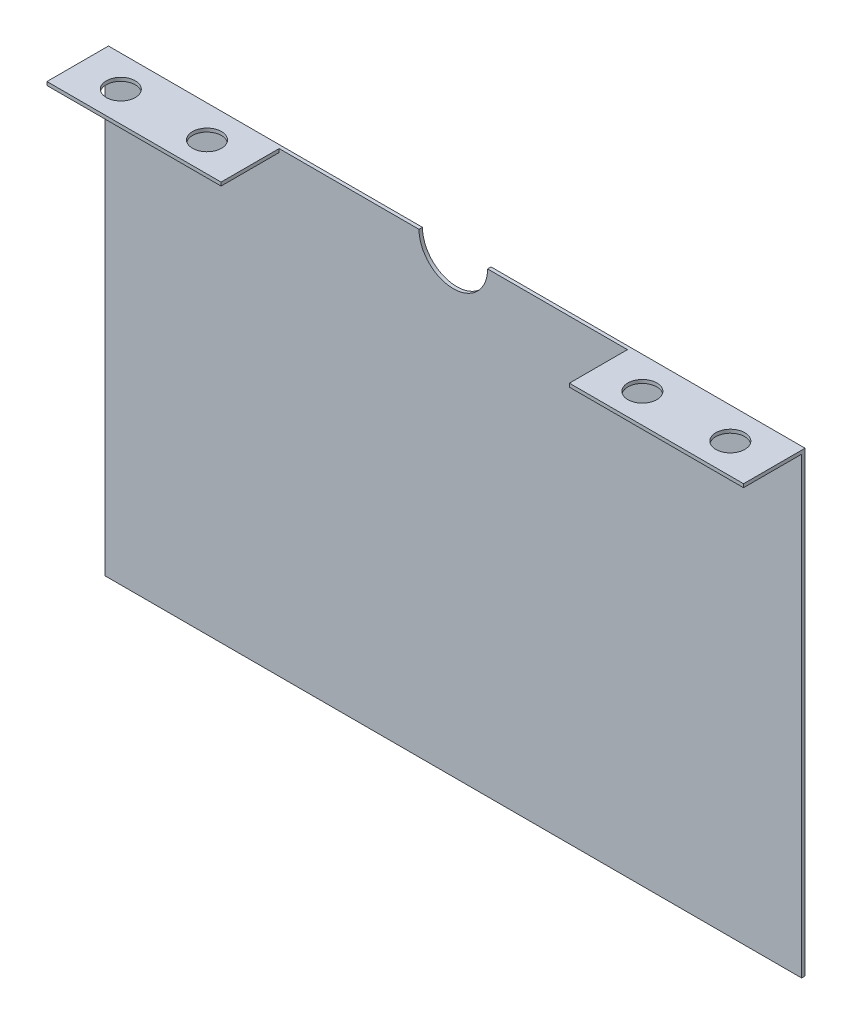
ISO-10303-21;
HEADER;
FILE_DESCRIPTION(('STEP AP214'),'2;1');
FILE_NAME('part.step','',(''),(''),'','','');
FILE_SCHEMA(('AUTOMOTIVE_DESIGN { 1 0 10303 214 1 1 1 1 }'));
ENDSEC;
DATA;
#1=APPLICATION_CONTEXT('core data for automotive mechanical design processes');
#2=APPLICATION_PROTOCOL_DEFINITION('international standard','automotive_design',2000,#1);
#3=PRODUCT_CONTEXT('',#1,'mechanical');
#4=PRODUCT('Part','Part','',(#3));
#5=PRODUCT_RELATED_PRODUCT_CATEGORY('part','',(#4));
#6=PRODUCT_DEFINITION_FORMATION('','',#4);
#7=PRODUCT_DEFINITION_CONTEXT('part definition',#1,'design');
#8=PRODUCT_DEFINITION('design','',#6,#7);
#9=PRODUCT_DEFINITION_SHAPE('','',#8);
#10=(LENGTH_UNIT() NAMED_UNIT(*) SI_UNIT(.MILLI.,.METRE.));
#11=(NAMED_UNIT(*) PLANE_ANGLE_UNIT() SI_UNIT($,.RADIAN.));
#12=(NAMED_UNIT(*) SI_UNIT($,.STERADIAN.) SOLID_ANGLE_UNIT());
#13=UNCERTAINTY_MEASURE_WITH_UNIT(LENGTH_MEASURE(1.E-05),#10,'distance_accuracy_value','');
#14=(GEOMETRIC_REPRESENTATION_CONTEXT(3) GLOBAL_UNCERTAINTY_ASSIGNED_CONTEXT((#13)) GLOBAL_UNIT_ASSIGNED_CONTEXT((#10,
#11,#12)) REPRESENTATION_CONTEXT('',''));
#15=CARTESIAN_POINT('',(0.,0.,0.));
#16=DIRECTION('',(0.,0.,1.));
#17=DIRECTION('',(1.,0.,0.));
#18=AXIS2_PLACEMENT_3D('',#15,#16,#17);
#19=CARTESIAN_POINT('',(0.,100.,1.51892));
#20=DIRECTION('',(0.,0.,-1.));
#21=DIRECTION('',(-1.,0.,0.));
#22=AXIS2_PLACEMENT_3D('',#19,#20,#21);
#23=PLANE('',#22);
#24=DIRECTION('',(0.,-1.,0.));
#25=VECTOR('',#24,1.);
#26=CARTESIAN_POINT('',(76.2,100.,1.51892));
#27=LINE('',#26,#25);
#28=CARTESIAN_POINT('',(76.2,100.,1.51892));
#29=VERTEX_POINT('',#28);
#30=CARTESIAN_POINT('',(76.2,98.48108,1.51892));
#31=VERTEX_POINT('',#30);
#32=EDGE_CURVE('E155',#29,#31,#27,.T.);
#33=ORIENTED_EDGE('',*,*,#32,.F.);
#34=DIRECTION('',(-1.,0.,0.));
#35=VECTOR('',#34,1.);
#36=CARTESIAN_POINT('',(15.,100.,1.51892));
#37=LINE('',#36,#35);
#38=CARTESIAN_POINT('',(15.,100.,1.51892));
#39=VERTEX_POINT('',#38);
#40=EDGE_CURVE('E202',#29,#39,#37,.T.);
#41=ORIENTED_EDGE('',*,*,#40,.T.);
#42=CARTESIAN_POINT('',(0.,100.,1.51892));
#43=DIRECTION('',(0.,0.,-1.));
#44=DIRECTION('',(-1.,0.,0.));
#45=AXIS2_PLACEMENT_3D('',#42,#43,#44);
#46=CIRCLE('',#45,15.);
#47=CARTESIAN_POINT('',(-15.,100.,1.51892));
#48=VERTEX_POINT('',#47);
#49=EDGE_CURVE('E204',#39,#48,#46,.T.);
#50=ORIENTED_EDGE('',*,*,#49,.T.);
#51=DIRECTION('',(-1.,0.,0.));
#52=VECTOR('',#51,1.);
#53=CARTESIAN_POINT('',(-152.4,100.,1.51892));
#54=LINE('',#53,#52);
#55=CARTESIAN_POINT('',(-76.2,100.,1.51892));
#56=VERTEX_POINT('',#55);
#57=EDGE_CURVE('E206',#48,#56,#54,.T.);
#58=ORIENTED_EDGE('',*,*,#57,.T.);
#59=DIRECTION('',(0.,1.,0.));
#60=VECTOR('',#59,1.);
#61=CARTESIAN_POINT('',(-76.2,100.,1.51892));
#62=LINE('',#61,#60);
#63=CARTESIAN_POINT('',(-76.2,98.48108,1.51892));
#64=VERTEX_POINT('',#63);
#65=EDGE_CURVE('E175',#64,#56,#62,.T.);
#66=ORIENTED_EDGE('',*,*,#65,.F.);
#67=DIRECTION('',(1.,0.,0.));
#68=VECTOR('',#67,1.);
#69=CARTESIAN_POINT('',(-152.4,98.48108,1.51892));
#70=LINE('',#69,#68);
#71=CARTESIAN_POINT('',(-152.4,98.48108,1.51892));
#72=VERTEX_POINT('',#71);
#73=EDGE_CURVE('E170',#72,#64,#70,.T.);
#74=ORIENTED_EDGE('',*,*,#73,.F.);
#75=DIRECTION('',(0.,-1.,0.));
#76=VECTOR('',#75,1.);
#77=CARTESIAN_POINT('',(-152.4,100.,1.51892));
#78=LINE('',#77,#76);
#79=CARTESIAN_POINT('',(-152.4,-100.,1.51892));
#80=VERTEX_POINT('',#79);
#81=EDGE_CURVE('E196',#72,#80,#78,.T.);
#82=ORIENTED_EDGE('',*,*,#81,.T.);
#83=DIRECTION('',(1.,0.,0.));
#84=VECTOR('',#83,1.);
#85=CARTESIAN_POINT('',(-152.4,-100.,1.51892));
#86=LINE('',#85,#84);
#87=CARTESIAN_POINT('',(152.4,-100.,1.51892));
#88=VERTEX_POINT('',#87);
#89=EDGE_CURVE('E198',#80,#88,#86,.T.);
#90=ORIENTED_EDGE('',*,*,#89,.T.);
#91=DIRECTION('',(0.,1.,0.));
#92=VECTOR('',#91,1.);
#93=CARTESIAN_POINT('',(152.4,100.,1.51892));
#94=LINE('',#93,#92);
#95=CARTESIAN_POINT('',(152.4,98.48108,1.51892));
#96=VERTEX_POINT('',#95);
#97=EDGE_CURVE('E60',#88,#96,#94,.T.);
#98=ORIENTED_EDGE('',*,*,#97,.T.);
#99=DIRECTION('',(1.,0.,0.));
#100=VECTOR('',#99,1.);
#101=CARTESIAN_POINT('',(152.4,98.48108,1.51892));
#102=LINE('',#101,#100);
#103=EDGE_CURVE('E55',#31,#96,#102,.T.);
#104=ORIENTED_EDGE('',*,*,#103,.F.);
#105=EDGE_LOOP('',(#33,#41,#50,#58,#66,#74,#82,#90,#98,#104));
#106=FACE_BOUND('',#105,.T.);
#107=ADVANCED_FACE('F38',(#106),#23,.F.);
#108=CARTESIAN_POINT('',(-152.4,100.,1.51892));
#109=DIRECTION('',(1.,0.,0.));
#110=DIRECTION('',(0.,0.,-1.));
#111=AXIS2_PLACEMENT_3D('',#108,#109,#110);
#112=PLANE('',#111);
#113=DIRECTION('',(0.,-1.,0.));
#114=VECTOR('',#113,1.);
#115=CARTESIAN_POINT('',(-152.4,100.,0.));
#116=LINE('',#115,#114);
#117=CARTESIAN_POINT('',(-152.4,100.,0.));
#118=VERTEX_POINT('',#117);
#119=CARTESIAN_POINT('',(-152.4,-100.,0.));
#120=VERTEX_POINT('',#119);
#121=EDGE_CURVE('E195',#118,#120,#116,.T.);
#122=ORIENTED_EDGE('',*,*,#121,.T.);
#123=DIRECTION('',(0.,0.,-1.));
#124=VECTOR('',#123,1.);
#125=CARTESIAN_POINT('',(-152.4,-100.,1.51892));
#126=LINE('',#125,#124);
#127=EDGE_CURVE('E11',#80,#120,#126,.T.);
#128=ORIENTED_EDGE('',*,*,#127,.F.);
#129=ORIENTED_EDGE('',*,*,#81,.F.);
#130=DIRECTION('',(0.,0.,-1.));
#131=VECTOR('',#130,1.);
#132=CARTESIAN_POINT('',(-152.4,98.48108,26.91892));
#133=LINE('',#132,#131);
#134=CARTESIAN_POINT('',(-152.4,98.48108,26.91892));
#135=VERTEX_POINT('',#134);
#136=EDGE_CURVE('E192',#135,#72,#133,.T.);
#137=ORIENTED_EDGE('',*,*,#136,.F.);
#138=DIRECTION('',(0.,-1.,0.));
#139=VECTOR('',#138,1.);
#140=CARTESIAN_POINT('',(-152.4,100.,26.91892));
#141=LINE('',#140,#139);
#142=CARTESIAN_POINT('',(-152.4,100.,26.91892));
#143=VERTEX_POINT('',#142);
#144=EDGE_CURVE('E171',#143,#135,#141,.T.);
#145=ORIENTED_EDGE('',*,*,#144,.F.);
#146=DIRECTION('',(0.,0.,-1.));
#147=VECTOR('',#146,1.);
#148=CARTESIAN_POINT('',(-152.4,100.,1.51892));
#149=LINE('',#148,#147);
#150=EDGE_CURVE('E208',#143,#118,#149,.T.);
#151=ORIENTED_EDGE('',*,*,#150,.T.);
#152=EDGE_LOOP('',(#122,#128,#129,#137,#145,#151));
#153=FACE_BOUND('',#152,.T.);
#154=ADVANCED_FACE('F40',(#153),#112,.F.);
#155=CARTESIAN_POINT('',(-152.4,-100.,1.51892));
#156=DIRECTION('',(0.,1.,0.));
#157=DIRECTION('',(-1.,0.,0.));
#158=AXIS2_PLACEMENT_3D('',#155,#156,#157);
#159=PLANE('',#158);
#160=DIRECTION('',(1.,0.,0.));
#161=VECTOR('',#160,1.);
#162=CARTESIAN_POINT('',(-152.4,-100.,0.));
#163=LINE('',#162,#161);
#164=CARTESIAN_POINT('',(152.4,-100.,0.));
#165=VERTEX_POINT('',#164);
#166=EDGE_CURVE('E211',#120,#165,#163,.T.);
#167=ORIENTED_EDGE('',*,*,#166,.T.);
#168=DIRECTION('',(0.,0.,-1.));
#169=VECTOR('',#168,1.);
#170=CARTESIAN_POINT('',(152.4,-100.,1.51892));
#171=LINE('',#170,#169);
#172=EDGE_CURVE('E47',#88,#165,#171,.T.);
#173=ORIENTED_EDGE('',*,*,#172,.F.);
#174=ORIENTED_EDGE('',*,*,#89,.F.);
#175=ORIENTED_EDGE('',*,*,#127,.T.);
#176=EDGE_LOOP('',(#167,#173,#174,#175));
#177=FACE_BOUND('',#176,.T.);
#178=ADVANCED_FACE('F259',(#177),#159,.F.);
#179=CARTESIAN_POINT('',(152.4,100.,1.51892));
#180=DIRECTION('',(-1.,0.,0.));
#181=DIRECTION('',(0.,0.,1.));
#182=AXIS2_PLACEMENT_3D('',#179,#180,#181);
#183=PLANE('',#182);
#184=DIRECTION('',(0.,1.,0.));
#185=VECTOR('',#184,1.);
#186=CARTESIAN_POINT('',(152.4,100.,0.));
#187=LINE('',#186,#185);
#188=CARTESIAN_POINT('',(152.4,100.,0.));
#189=VERTEX_POINT('',#188);
#190=EDGE_CURVE('E136',#165,#189,#187,.T.);
#191=ORIENTED_EDGE('',*,*,#190,.T.);
#192=DIRECTION('',(0.,0.,-1.));
#193=VECTOR('',#192,1.);
#194=CARTESIAN_POINT('',(152.4,100.,1.51892));
#195=LINE('',#194,#193);
#196=CARTESIAN_POINT('',(152.4,100.,26.91892));
#197=VERTEX_POINT('',#196);
#198=EDGE_CURVE('E128',#197,#189,#195,.T.);
#199=ORIENTED_EDGE('',*,*,#198,.F.);
#200=DIRECTION('',(0.,1.,0.));
#201=VECTOR('',#200,1.);
#202=CARTESIAN_POINT('',(152.4,100.,26.91892));
#203=LINE('',#202,#201);
#204=CARTESIAN_POINT('',(152.4,98.48108,26.91892));
#205=VERTEX_POINT('',#204);
#206=EDGE_CURVE('E133',#205,#197,#203,.T.);
#207=ORIENTED_EDGE('',*,*,#206,.F.);
#208=DIRECTION('',(0.,0.,-1.));
#209=VECTOR('',#208,1.);
#210=CARTESIAN_POINT('',(152.4,98.48108,26.91892));
#211=LINE('',#210,#209);
#212=EDGE_CURVE('E163',#205,#96,#211,.T.);
#213=ORIENTED_EDGE('',*,*,#212,.T.);
#214=ORIENTED_EDGE('',*,*,#97,.F.);
#215=ORIENTED_EDGE('',*,*,#172,.T.);
#216=EDGE_LOOP('',(#191,#199,#207,#213,#214,#215));
#217=FACE_BOUND('',#216,.T.);
#218=ADVANCED_FACE('F130',(#217),#183,.F.);
#219=CARTESIAN_POINT('',(15.,100.,1.51892));
#220=DIRECTION('',(0.,-1.,0.));
#221=DIRECTION('',(1.,0.,0.));
#222=AXIS2_PLACEMENT_3D('',#219,#220,#221);
#223=PLANE('',#222);
#224=CARTESIAN_POINT('',(95.25,100.,14.029055));
#225=DIRECTION('',(0.,1.,0.));
#226=DIRECTION('',(0.,0.,-1.));
#227=AXIS2_PLACEMENT_3D('',#224,#225,#226);
#228=CIRCLE('',#227,6.35);
#229=CARTESIAN_POINT('',(95.25,100.,7.679055));
#230=VERTEX_POINT('',#229);
#231=EDGE_CURVE('E413',#230,#230,#228,.T.);
#232=ORIENTED_EDGE('',*,*,#231,.F.);
#233=EDGE_LOOP('',(#232));
#234=FACE_BOUND('',#233,.T.);
#235=CARTESIAN_POINT('',(133.35,100.,13.649325));
#236=DIRECTION('',(0.,1.,0.));
#237=DIRECTION('',(0.,0.,-1.));
#238=AXIS2_PLACEMENT_3D('',#235,#236,#237);
#239=CIRCLE('',#238,6.35);
#240=CARTESIAN_POINT('',(133.35,100.,7.299325));
#241=VERTEX_POINT('',#240);
#242=EDGE_CURVE('E158',#241,#241,#239,.T.);
#243=ORIENTED_EDGE('',*,*,#242,.F.);
#244=EDGE_LOOP('',(#243));
#245=FACE_BOUND('',#244,.T.);
#246=DIRECTION('',(-1.,0.,0.));
#247=VECTOR('',#246,1.);
#248=CARTESIAN_POINT('',(15.,100.,0.));
#249=LINE('',#248,#247);
#250=CARTESIAN_POINT('',(15.,100.,0.));
#251=VERTEX_POINT('',#250);
#252=EDGE_CURVE('E214',#189,#251,#249,.T.);
#253=ORIENTED_EDGE('',*,*,#252,.T.);
#254=DIRECTION('',(0.,0.,-1.));
#255=VECTOR('',#254,1.);
#256=CARTESIAN_POINT('',(15.,100.,1.51892));
#257=LINE('',#256,#255);
#258=EDGE_CURVE('E139',#39,#251,#257,.T.);
#259=ORIENTED_EDGE('',*,*,#258,.F.);
#260=ORIENTED_EDGE('',*,*,#40,.F.);
#261=DIRECTION('',(0.,0.,-1.));
#262=VECTOR('',#261,1.);
#263=CARTESIAN_POINT('',(76.2,100.,26.91892));
#264=LINE('',#263,#262);
#265=CARTESIAN_POINT('',(76.2,100.,26.91892));
#266=VERTEX_POINT('',#265);
#267=EDGE_CURVE('E145',#266,#29,#264,.T.);
#268=ORIENTED_EDGE('',*,*,#267,.F.);
#269=DIRECTION('',(-1.,0.,0.));
#270=VECTOR('',#269,1.);
#271=CARTESIAN_POINT('',(152.4,100.,26.91892));
#272=LINE('',#271,#270);
#273=EDGE_CURVE('E142',#197,#266,#272,.T.);
#274=ORIENTED_EDGE('',*,*,#273,.F.);
#275=ORIENTED_EDGE('',*,*,#198,.T.);
#276=EDGE_LOOP('',(#253,#259,#260,#268,#274,#275));
#277=FACE_BOUND('',#276,.T.);
#278=ADVANCED_FACE('F143',(#234,#245,#277),#223,.F.);
#279=CARTESIAN_POINT('',(0.,100.,1.51892));
#280=DIRECTION('',(0.,0.,-1.));
#281=DIRECTION('',(-1.,0.,0.));
#282=AXIS2_PLACEMENT_3D('',#279,#280,#281);
#283=CYLINDRICAL_SURFACE('',#282,15.);
#284=CARTESIAN_POINT('',(0.,100.,0.));
#285=DIRECTION('',(0.,0.,-1.));
#286=DIRECTION('',(-1.,0.,0.));
#287=AXIS2_PLACEMENT_3D('',#284,#285,#286);
#288=CIRCLE('',#287,15.);
#289=CARTESIAN_POINT('',(-15.,100.,0.));
#290=VERTEX_POINT('',#289);
#291=EDGE_CURVE('E216',#251,#290,#288,.T.);
#292=ORIENTED_EDGE('',*,*,#291,.T.);
#293=DIRECTION('',(0.,0.,-1.));
#294=VECTOR('',#293,1.);
#295=CARTESIAN_POINT('',(-15.,100.,1.51892));
#296=LINE('',#295,#294);
#297=EDGE_CURVE('E221',#48,#290,#296,.T.);
#298=ORIENTED_EDGE('',*,*,#297,.F.);
#299=ORIENTED_EDGE('',*,*,#49,.F.);
#300=ORIENTED_EDGE('',*,*,#258,.T.);
#301=EDGE_LOOP('',(#292,#298,#299,#300));
#302=FACE_BOUND('',#301,.T.);
#303=ADVANCED_FACE('F271',(#302),#283,.F.);
#304=CARTESIAN_POINT('',(-152.4,100.,1.51892));
#305=DIRECTION('',(0.,-1.,0.));
#306=DIRECTION('',(0.,0.,-1.));
#307=AXIS2_PLACEMENT_3D('',#304,#305,#306);
#308=PLANE('',#307);
#309=CARTESIAN_POINT('',(-133.35,100.,13.649325));
#310=DIRECTION('',(0.,1.,0.));
#311=DIRECTION('',(0.,0.,1.));
#312=AXIS2_PLACEMENT_3D('',#309,#310,#311);
#313=CIRCLE('',#312,6.35);
#314=CARTESIAN_POINT('',(-133.35,100.,19.999325));
#315=VERTEX_POINT('',#314);
#316=EDGE_CURVE('E231',#315,#315,#313,.T.);
#317=ORIENTED_EDGE('',*,*,#316,.F.);
#318=EDGE_LOOP('',(#317));
#319=FACE_BOUND('',#318,.T.);
#320=CARTESIAN_POINT('',(-95.25,100.,14.029055));
#321=DIRECTION('',(0.,1.,0.));
#322=DIRECTION('',(0.,0.,1.));
#323=AXIS2_PLACEMENT_3D('',#320,#321,#322);
#324=CIRCLE('',#323,6.35);
#325=CARTESIAN_POINT('',(-95.25,100.,20.379055));
#326=VERTEX_POINT('',#325);
#327=EDGE_CURVE('E415',#326,#326,#324,.T.);
#328=ORIENTED_EDGE('',*,*,#327,.F.);
#329=EDGE_LOOP('',(#328));
#330=FACE_BOUND('',#329,.T.);
#331=DIRECTION('',(-1.,0.,0.));
#332=VECTOR('',#331,1.);
#333=CARTESIAN_POINT('',(-152.4,100.,0.));
#334=LINE('',#333,#332);
#335=EDGE_CURVE('E199',#290,#118,#334,.T.);
#336=ORIENTED_EDGE('',*,*,#335,.T.);
#337=ORIENTED_EDGE('',*,*,#150,.F.);
#338=DIRECTION('',(-1.,0.,0.));
#339=VECTOR('',#338,1.);
#340=CARTESIAN_POINT('',(-152.4,100.,26.91892));
#341=LINE('',#340,#339);
#342=CARTESIAN_POINT('',(-76.2,100.,26.91892));
#343=VERTEX_POINT('',#342);
#344=EDGE_CURVE('E179',#343,#143,#341,.T.);
#345=ORIENTED_EDGE('',*,*,#344,.F.);
#346=DIRECTION('',(0.,0.,-1.));
#347=VECTOR('',#346,1.);
#348=CARTESIAN_POINT('',(-76.2,100.,26.91892));
#349=LINE('',#348,#347);
#350=EDGE_CURVE('E182',#343,#56,#349,.T.);
#351=ORIENTED_EDGE('',*,*,#350,.T.);
#352=ORIENTED_EDGE('',*,*,#57,.F.);
#353=ORIENTED_EDGE('',*,*,#297,.T.);
#354=EDGE_LOOP('',(#336,#337,#345,#351,#352,#353));
#355=FACE_BOUND('',#354,.T.);
#356=ADVANCED_FACE('F267',(#319,#330,#355),#308,.F.);
#357=CARTESIAN_POINT('',(0.,100.,0.));
#358=DIRECTION('',(0.,0.,-1.));
#359=DIRECTION('',(-1.,0.,0.));
#360=AXIS2_PLACEMENT_3D('',#357,#358,#359);
#361=PLANE('',#360);
#362=ORIENTED_EDGE('',*,*,#121,.F.);
#363=ORIENTED_EDGE('',*,*,#335,.F.);
#364=ORIENTED_EDGE('',*,*,#291,.F.);
#365=ORIENTED_EDGE('',*,*,#252,.F.);
#366=ORIENTED_EDGE('',*,*,#190,.F.);
#367=ORIENTED_EDGE('',*,*,#166,.F.);
#368=EDGE_LOOP('',(#362,#363,#364,#365,#366,#367));
#369=FACE_BOUND('',#368,.T.);
#370=ADVANCED_FACE('F264',(#369),#361,.T.);
#371=CARTESIAN_POINT('',(-152.4,98.48108,26.91892));
#372=DIRECTION('',(0.,1.,0.));
#373=DIRECTION('',(0.,0.,1.));
#374=AXIS2_PLACEMENT_3D('',#371,#372,#373);
#375=PLANE('',#374);
#376=CARTESIAN_POINT('',(-133.35,98.48108,13.649325));
#377=DIRECTION('',(0.,1.,0.));
#378=DIRECTION('',(0.,0.,1.));
#379=AXIS2_PLACEMENT_3D('',#376,#377,#378);
#380=CIRCLE('',#379,6.35);
#381=CARTESIAN_POINT('',(-133.35,98.48108,19.999325));
#382=VERTEX_POINT('',#381);
#383=EDGE_CURVE('E42',#382,#382,#380,.T.);
#384=ORIENTED_EDGE('',*,*,#383,.T.);
#385=EDGE_LOOP('',(#384));
#386=FACE_BOUND('',#385,.T.);
#387=CARTESIAN_POINT('',(-95.25,98.48108,14.029055));
#388=DIRECTION('',(0.,1.,0.));
#389=DIRECTION('',(0.,0.,1.));
#390=AXIS2_PLACEMENT_3D('',#387,#388,#389);
#391=CIRCLE('',#390,6.35);
#392=CARTESIAN_POINT('',(-95.25,98.48108,20.379055));
#393=VERTEX_POINT('',#392);
#394=EDGE_CURVE('E233',#393,#393,#391,.T.);
#395=ORIENTED_EDGE('',*,*,#394,.T.);
#396=EDGE_LOOP('',(#395));
#397=FACE_BOUND('',#396,.T.);
#398=ORIENTED_EDGE('',*,*,#73,.T.);
#399=DIRECTION('',(0.,0.,-1.));
#400=VECTOR('',#399,1.);
#401=CARTESIAN_POINT('',(-76.2,98.48108,26.91892));
#402=LINE('',#401,#400);
#403=CARTESIAN_POINT('',(-76.2,98.48108,26.91892));
#404=VERTEX_POINT('',#403);
#405=EDGE_CURVE('E189',#404,#64,#402,.T.);
#406=ORIENTED_EDGE('',*,*,#405,.F.);
#407=DIRECTION('',(1.,0.,0.));
#408=VECTOR('',#407,1.);
#409=CARTESIAN_POINT('',(-152.4,98.48108,26.91892));
#410=LINE('',#409,#408);
#411=EDGE_CURVE('E174',#135,#404,#410,.T.);
#412=ORIENTED_EDGE('',*,*,#411,.F.);
#413=ORIENTED_EDGE('',*,*,#136,.T.);
#414=EDGE_LOOP('',(#398,#406,#412,#413));
#415=FACE_BOUND('',#414,.T.);
#416=ADVANCED_FACE('F240',(#386,#397,#415),#375,.F.);
#417=CARTESIAN_POINT('',(-76.2,100.,26.91892));
#418=DIRECTION('',(-1.,0.,0.));
#419=DIRECTION('',(0.,-1.,0.));
#420=AXIS2_PLACEMENT_3D('',#417,#418,#419);
#421=PLANE('',#420);
#422=ORIENTED_EDGE('',*,*,#65,.T.);
#423=ORIENTED_EDGE('',*,*,#350,.F.);
#424=DIRECTION('',(0.,1.,0.));
#425=VECTOR('',#424,1.);
#426=CARTESIAN_POINT('',(-76.2,100.,26.91892));
#427=LINE('',#426,#425);
#428=EDGE_CURVE('E177',#404,#343,#427,.T.);
#429=ORIENTED_EDGE('',*,*,#428,.F.);
#430=ORIENTED_EDGE('',*,*,#405,.T.);
#431=EDGE_LOOP('',(#422,#423,#429,#430));
#432=FACE_BOUND('',#431,.T.);
#433=ADVANCED_FACE('F314',(#432),#421,.F.);
#434=CARTESIAN_POINT('',(0.,0.,26.91892));
#435=DIRECTION('',(0.,0.,1.));
#436=DIRECTION('',(1.,0.,0.));
#437=AXIS2_PLACEMENT_3D('',#434,#435,#436);
#438=PLANE('',#437);
#439=ORIENTED_EDGE('',*,*,#144,.T.);
#440=ORIENTED_EDGE('',*,*,#411,.T.);
#441=ORIENTED_EDGE('',*,*,#428,.T.);
#442=ORIENTED_EDGE('',*,*,#344,.T.);
#443=EDGE_LOOP('',(#439,#440,#441,#442));
#444=FACE_BOUND('',#443,.T.);
#445=ADVANCED_FACE('F308',(#444),#438,.T.);
#446=CARTESIAN_POINT('',(76.2,100.,26.91892));
#447=DIRECTION('',(1.,0.,0.));
#448=DIRECTION('',(0.,1.,0.));
#449=AXIS2_PLACEMENT_3D('',#446,#447,#448);
#450=PLANE('',#449);
#451=ORIENTED_EDGE('',*,*,#32,.T.);
#452=DIRECTION('',(0.,0.,-1.));
#453=VECTOR('',#452,1.);
#454=CARTESIAN_POINT('',(76.2,98.48108,26.91892));
#455=LINE('',#454,#453);
#456=CARTESIAN_POINT('',(76.2,98.48108,26.91892));
#457=VERTEX_POINT('',#456);
#458=EDGE_CURVE('E166',#457,#31,#455,.T.);
#459=ORIENTED_EDGE('',*,*,#458,.F.);
#460=DIRECTION('',(0.,-1.,0.));
#461=VECTOR('',#460,1.);
#462=CARTESIAN_POINT('',(76.2,100.,26.91892));
#463=LINE('',#462,#461);
#464=EDGE_CURVE('E148',#266,#457,#463,.T.);
#465=ORIENTED_EDGE('',*,*,#464,.F.);
#466=ORIENTED_EDGE('',*,*,#267,.T.);
#467=EDGE_LOOP('',(#451,#459,#465,#466));
#468=FACE_BOUND('',#467,.T.);
#469=ADVANCED_FACE('F296',(#468),#450,.F.);
#470=CARTESIAN_POINT('',(152.4,98.48108,26.91892));
#471=DIRECTION('',(0.,1.,0.));
#472=DIRECTION('',(-1.,0.,0.));
#473=AXIS2_PLACEMENT_3D('',#470,#471,#472);
#474=PLANE('',#473);
#475=CARTESIAN_POINT('',(95.25,98.48108,14.029055));
#476=DIRECTION('',(0.,1.,0.));
#477=DIRECTION('',(-1.,0.,0.));
#478=AXIS2_PLACEMENT_3D('',#475,#476,#477);
#479=CIRCLE('',#478,6.35);
#480=CARTESIAN_POINT('',(88.9,98.48108,14.029055));
#481=VERTEX_POINT('',#480);
#482=EDGE_CURVE('E230',#481,#481,#479,.T.);
#483=ORIENTED_EDGE('',*,*,#482,.T.);
#484=EDGE_LOOP('',(#483));
#485=FACE_BOUND('',#484,.T.);
#486=CARTESIAN_POINT('',(133.35,98.48108,13.649325));
#487=DIRECTION('',(0.,1.,0.));
#488=DIRECTION('',(-1.,0.,0.));
#489=AXIS2_PLACEMENT_3D('',#486,#487,#488);
#490=CIRCLE('',#489,6.35);
#491=CARTESIAN_POINT('',(127.,98.48108,13.649325));
#492=VERTEX_POINT('',#491);
#493=EDGE_CURVE('E227',#492,#492,#490,.T.);
#494=ORIENTED_EDGE('',*,*,#493,.T.);
#495=EDGE_LOOP('',(#494));
#496=FACE_BOUND('',#495,.T.);
#497=ORIENTED_EDGE('',*,*,#103,.T.);
#498=ORIENTED_EDGE('',*,*,#212,.F.);
#499=DIRECTION('',(1.,0.,0.));
#500=VECTOR('',#499,1.);
#501=CARTESIAN_POINT('',(152.4,98.48108,26.91892));
#502=LINE('',#501,#500);
#503=EDGE_CURVE('E152',#457,#205,#502,.T.);
#504=ORIENTED_EDGE('',*,*,#503,.F.);
#505=ORIENTED_EDGE('',*,*,#458,.T.);
#506=EDGE_LOOP('',(#497,#498,#504,#505));
#507=FACE_BOUND('',#506,.T.);
#508=ADVANCED_FACE('F298',(#485,#496,#507),#474,.F.);
#509=CARTESIAN_POINT('',(0.,0.,26.91892));
#510=DIRECTION('',(0.,0.,-1.));
#511=DIRECTION('',(-1.,0.,0.));
#512=AXIS2_PLACEMENT_3D('',#509,#510,#511);
#513=PLANE('',#512);
#514=ORIENTED_EDGE('',*,*,#206,.T.);
#515=ORIENTED_EDGE('',*,*,#273,.T.);
#516=ORIENTED_EDGE('',*,*,#464,.T.);
#517=ORIENTED_EDGE('',*,*,#503,.T.);
#518=EDGE_LOOP('',(#514,#515,#516,#517));
#519=FACE_BOUND('',#518,.T.);
#520=ADVANCED_FACE('F150',(#519),#513,.F.);
#521=CARTESIAN_POINT('',(133.35,74.6,13.649325));
#522=DIRECTION('',(0.,1.,0.));
#523=DIRECTION('',(0.,0.,1.));
#524=AXIS2_PLACEMENT_3D('',#521,#522,#523);
#525=CYLINDRICAL_SURFACE('',#524,6.35);
#526=ORIENTED_EDGE('',*,*,#242,.T.);
#527=EDGE_LOOP('',(#526));
#528=FACE_BOUND('',#527,.T.);
#529=ORIENTED_EDGE('',*,*,#493,.F.);
#530=EDGE_LOOP('',(#529));
#531=FACE_BOUND('',#530,.T.);
#532=ADVANCED_FACE('F306',(#528,#531),#525,.F.);
#533=CARTESIAN_POINT('',(95.25,74.6,14.029055));
#534=DIRECTION('',(0.,1.,0.));
#535=DIRECTION('',(0.,0.,1.));
#536=AXIS2_PLACEMENT_3D('',#533,#534,#535);
#537=CYLINDRICAL_SURFACE('',#536,6.35);
#538=ORIENTED_EDGE('',*,*,#231,.T.);
#539=EDGE_LOOP('',(#538));
#540=FACE_BOUND('',#539,.T.);
#541=ORIENTED_EDGE('',*,*,#482,.F.);
#542=EDGE_LOOP('',(#541));
#543=FACE_BOUND('',#542,.T.);
#544=ADVANCED_FACE('F250',(#540,#543),#537,.F.);
#545=CARTESIAN_POINT('',(-95.25,74.6,14.029055));
#546=DIRECTION('',(0.,1.,0.));
#547=DIRECTION('',(0.,0.,1.));
#548=AXIS2_PLACEMENT_3D('',#545,#546,#547);
#549=CYLINDRICAL_SURFACE('',#548,6.35);
#550=ORIENTED_EDGE('',*,*,#327,.T.);
#551=EDGE_LOOP('',(#550));
#552=FACE_BOUND('',#551,.T.);
#553=ORIENTED_EDGE('',*,*,#394,.F.);
#554=EDGE_LOOP('',(#553));
#555=FACE_BOUND('',#554,.T.);
#556=ADVANCED_FACE('F244',(#552,#555),#549,.F.);
#557=CARTESIAN_POINT('',(-133.35,74.6,13.649325));
#558=DIRECTION('',(0.,1.,0.));
#559=DIRECTION('',(0.,0.,1.));
#560=AXIS2_PLACEMENT_3D('',#557,#558,#559);
#561=CYLINDRICAL_SURFACE('',#560,6.35);
#562=ORIENTED_EDGE('',*,*,#316,.T.);
#563=EDGE_LOOP('',(#562));
#564=FACE_BOUND('',#563,.T.);
#565=ORIENTED_EDGE('',*,*,#383,.F.);
#566=EDGE_LOOP('',(#565));
#567=FACE_BOUND('',#566,.T.);
#568=ADVANCED_FACE('F242',(#564,#567),#561,.F.);
#569=CLOSED_SHELL('',(#107,#154,#178,#218,#278,#303,#356,#370,#416,#433,#445,#469,#508,#520,
#532,#544,#556,#568));
#570=MANIFOLD_SOLID_BREP('B2',#569);
#571=ADVANCED_BREP_SHAPE_REPRESENTATION('',(#18,#570),#14);
#572=SHAPE_DEFINITION_REPRESENTATION(#9,#571);
ENDSEC;
END-ISO-10303-21;
